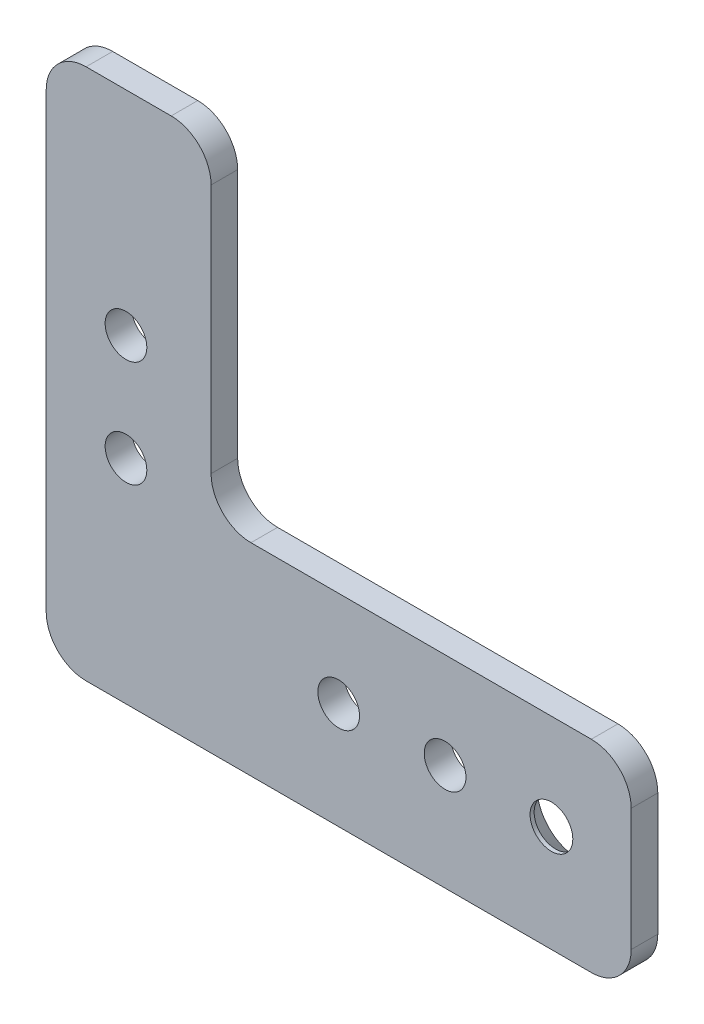
ISO-10303-21;
HEADER;
FILE_DESCRIPTION(('STEP AP214'),'2;1');
FILE_NAME('part.step','',(''),(''),'','','');
FILE_SCHEMA(('AUTOMOTIVE_DESIGN { 1 0 10303 214 1 1 1 1 }'));
ENDSEC;
DATA;
#1=APPLICATION_CONTEXT('core data for automotive mechanical design processes');
#2=APPLICATION_PROTOCOL_DEFINITION('international standard','automotive_design',2000,#1);
#3=PRODUCT_CONTEXT('',#1,'mechanical');
#4=PRODUCT('Part','Part','',(#3));
#5=PRODUCT_RELATED_PRODUCT_CATEGORY('part','',(#4));
#6=PRODUCT_DEFINITION_FORMATION('','',#4);
#7=PRODUCT_DEFINITION_CONTEXT('part definition',#1,'design');
#8=PRODUCT_DEFINITION('design','',#6,#7);
#9=PRODUCT_DEFINITION_SHAPE('','',#8);
#10=(LENGTH_UNIT() NAMED_UNIT(*) SI_UNIT(.MILLI.,.METRE.));
#11=(NAMED_UNIT(*) PLANE_ANGLE_UNIT() SI_UNIT($,.RADIAN.));
#12=(NAMED_UNIT(*) SI_UNIT($,.STERADIAN.) SOLID_ANGLE_UNIT());
#13=UNCERTAINTY_MEASURE_WITH_UNIT(LENGTH_MEASURE(1.E-05),#10,'distance_accuracy_value','');
#14=(GEOMETRIC_REPRESENTATION_CONTEXT(3) GLOBAL_UNCERTAINTY_ASSIGNED_CONTEXT((#13)) GLOBAL_UNIT_ASSIGNED_CONTEXT((#10,
#11,#12)) REPRESENTATION_CONTEXT('',''));
#15=CARTESIAN_POINT('',(0.,0.,0.));
#16=DIRECTION('',(0.,0.,1.));
#17=DIRECTION('',(1.,0.,0.));
#18=AXIS2_PLACEMENT_3D('',#15,#16,#17);
#19=CARTESIAN_POINT('',(-34.925,-31.75,-3.175));
#20=DIRECTION('',(1.,0.,0.));
#21=DIRECTION('',(0.,0.,-1.));
#22=AXIS2_PLACEMENT_3D('',#19,#20,#21);
#23=PLANE('',#22);
#24=DIRECTION('',(0.,1.,0.));
#25=VECTOR('',#24,1.);
#26=CARTESIAN_POINT('',(-34.925,-31.75,0.));
#27=LINE('',#26,#25);
#28=CARTESIAN_POINT('',(-34.925,-26.9875,0.));
#29=VERTEX_POINT('',#28);
#30=CARTESIAN_POINT('',(-34.925,26.9875,0.));
#31=VERTEX_POINT('',#30);
#32=EDGE_CURVE('E133',#29,#31,#27,.T.);
#33=ORIENTED_EDGE('',*,*,#32,.T.);
#34=DIRECTION('',(0.,0.,1.));
#35=VECTOR('',#34,1.);
#36=CARTESIAN_POINT('',(-34.925,26.9875,-3.175));
#37=LINE('',#36,#35);
#38=CARTESIAN_POINT('',(-34.925,26.9875,-3.175));
#39=VERTEX_POINT('',#38);
#40=EDGE_CURVE('E198',#31,#39,#37,.F.);
#41=ORIENTED_EDGE('',*,*,#40,.T.);
#42=DIRECTION('',(0.,1.,0.));
#43=VECTOR('',#42,1.);
#44=CARTESIAN_POINT('',(-34.925,-31.75,-3.175));
#45=LINE('',#44,#43);
#46=CARTESIAN_POINT('',(-34.925,-26.9875,-3.175));
#47=VERTEX_POINT('',#46);
#48=EDGE_CURVE('E149',#47,#39,#45,.T.);
#49=ORIENTED_EDGE('',*,*,#48,.F.);
#50=DIRECTION('',(0.,0.,1.));
#51=VECTOR('',#50,1.);
#52=CARTESIAN_POINT('',(-34.925,-26.9875,0.));
#53=LINE('',#52,#51);
#54=EDGE_CURVE('E196',#47,#29,#53,.T.);
#55=ORIENTED_EDGE('',*,*,#54,.T.);
#56=EDGE_LOOP('',(#33,#41,#49,#55));
#57=FACE_BOUND('',#56,.T.);
#58=ADVANCED_FACE('F38',(#57),#23,.F.);
#59=CARTESIAN_POINT('',(-15.24,31.75,-3.175));
#60=DIRECTION('',(0.,1.,0.));
#61=DIRECTION('',(0.,0.,1.));
#62=AXIS2_PLACEMENT_3D('',#59,#60,#61);
#63=PLANE('',#62);
#64=DIRECTION('',(-1.,0.,0.));
#65=VECTOR('',#64,1.);
#66=CARTESIAN_POINT('',(-15.24,31.75,-3.175));
#67=LINE('',#66,#65);
#68=CARTESIAN_POINT('',(-20.0025,31.75,-3.175));
#69=VERTEX_POINT('',#68);
#70=CARTESIAN_POINT('',(-30.1625,31.75,-3.175));
#71=VERTEX_POINT('',#70);
#72=EDGE_CURVE('E222',#69,#71,#67,.T.);
#73=ORIENTED_EDGE('',*,*,#72,.T.);
#74=DIRECTION('',(0.,0.,1.));
#75=VECTOR('',#74,1.);
#76=CARTESIAN_POINT('',(-30.1625,31.75,0.));
#77=LINE('',#76,#75);
#78=CARTESIAN_POINT('',(-30.1625,31.75,0.));
#79=VERTEX_POINT('',#78);
#80=EDGE_CURVE('E193',#71,#79,#77,.T.);
#81=ORIENTED_EDGE('',*,*,#80,.T.);
#82=DIRECTION('',(-1.,0.,0.));
#83=VECTOR('',#82,1.);
#84=CARTESIAN_POINT('',(-15.24,31.75,0.));
#85=LINE('',#84,#83);
#86=CARTESIAN_POINT('',(-20.0025,31.75,0.));
#87=VERTEX_POINT('',#86);
#88=EDGE_CURVE('E212',#87,#79,#85,.T.);
#89=ORIENTED_EDGE('',*,*,#88,.F.);
#90=DIRECTION('',(0.,0.,1.));
#91=VECTOR('',#90,1.);
#92=CARTESIAN_POINT('',(-20.0025,31.75,-3.175));
#93=LINE('',#92,#91);
#94=EDGE_CURVE('E191',#87,#69,#93,.F.);
#95=ORIENTED_EDGE('',*,*,#94,.T.);
#96=EDGE_LOOP('',(#73,#81,#89,#95));
#97=FACE_BOUND('',#96,.T.);
#98=ADVANCED_FACE('F254',(#97),#63,.T.);
#99=CARTESIAN_POINT('',(-15.24,31.75,-3.175));
#100=DIRECTION('',(-1.,0.,0.));
#101=DIRECTION('',(0.,-1.,0.));
#102=AXIS2_PLACEMENT_3D('',#99,#100,#101);
#103=PLANE('',#102);
#104=DIRECTION('',(0.,-1.,0.));
#105=VECTOR('',#104,1.);
#106=CARTESIAN_POINT('',(-15.24,31.75,0.));
#107=LINE('',#106,#105);
#108=CARTESIAN_POINT('',(-15.24,26.9875,0.));
#109=VERTEX_POINT('',#108);
#110=CARTESIAN_POINT('',(-15.24,-2.85750000000001,0.));
#111=VERTEX_POINT('',#110);
#112=EDGE_CURVE('E203',#109,#111,#107,.T.);
#113=ORIENTED_EDGE('',*,*,#112,.T.);
#114=DIRECTION('',(0.,0.,1.));
#115=VECTOR('',#114,1.);
#116=CARTESIAN_POINT('',(-15.24,-2.85750000000001,-3.175));
#117=LINE('',#116,#115);
#118=CARTESIAN_POINT('',(-15.24,-2.85750000000001,-3.175));
#119=VERTEX_POINT('',#118);
#120=EDGE_CURVE('E189',#111,#119,#117,.F.);
#121=ORIENTED_EDGE('',*,*,#120,.T.);
#122=DIRECTION('',(0.,-1.,0.));
#123=VECTOR('',#122,1.);
#124=CARTESIAN_POINT('',(-15.24,31.75,-3.175));
#125=LINE('',#124,#123);
#126=CARTESIAN_POINT('',(-15.24,26.9875,-3.175));
#127=VERTEX_POINT('',#126);
#128=EDGE_CURVE('E218',#127,#119,#125,.T.);
#129=ORIENTED_EDGE('',*,*,#128,.F.);
#130=DIRECTION('',(0.,0.,1.));
#131=VECTOR('',#130,1.);
#132=CARTESIAN_POINT('',(-15.24,26.9875,0.));
#133=LINE('',#132,#131);
#134=EDGE_CURVE('E186',#127,#109,#133,.T.);
#135=ORIENTED_EDGE('',*,*,#134,.T.);
#136=EDGE_LOOP('',(#113,#121,#129,#135));
#137=FACE_BOUND('',#136,.T.);
#138=ADVANCED_FACE('F209',(#137),#103,.F.);
#139=CARTESIAN_POINT('',(34.925,-7.62000000000001,-3.175));
#140=DIRECTION('',(0.,1.,0.));
#141=DIRECTION('',(-1.,0.,0.));
#142=AXIS2_PLACEMENT_3D('',#139,#140,#141);
#143=PLANE('',#142);
#144=DIRECTION('',(-1.,0.,0.));
#145=VECTOR('',#144,1.);
#146=CARTESIAN_POINT('',(34.925,-7.62000000000001,0.));
#147=LINE('',#146,#145);
#148=CARTESIAN_POINT('',(30.1625,-7.62000000000001,0.));
#149=VERTEX_POINT('',#148);
#150=CARTESIAN_POINT('',(-10.4775,-7.62000000000001,0.));
#151=VERTEX_POINT('',#150);
#152=EDGE_CURVE('E204',#149,#151,#147,.T.);
#153=ORIENTED_EDGE('',*,*,#152,.F.);
#154=DIRECTION('',(0.,0.,1.));
#155=VECTOR('',#154,1.);
#156=CARTESIAN_POINT('',(30.1625,-7.62000000000001,-3.175));
#157=LINE('',#156,#155);
#158=CARTESIAN_POINT('',(30.1625,-7.62000000000001,-3.175));
#159=VERTEX_POINT('',#158);
#160=EDGE_CURVE('E59',#149,#159,#157,.F.);
#161=ORIENTED_EDGE('',*,*,#160,.T.);
#162=DIRECTION('',(-1.,0.,0.));
#163=VECTOR('',#162,1.);
#164=CARTESIAN_POINT('',(34.925,-7.62000000000001,-3.175));
#165=LINE('',#164,#163);
#166=CARTESIAN_POINT('',(-10.4775,-7.62000000000001,-3.175));
#167=VERTEX_POINT('',#166);
#168=EDGE_CURVE('E216',#159,#167,#165,.T.);
#169=ORIENTED_EDGE('',*,*,#168,.T.);
#170=DIRECTION('',(0.,0.,1.));
#171=VECTOR('',#170,1.);
#172=CARTESIAN_POINT('',(-10.4775,-7.62000000000001,-3.175));
#173=LINE('',#172,#171);
#174=EDGE_CURVE('E182',#167,#151,#173,.T.);
#175=ORIENTED_EDGE('',*,*,#174,.T.);
#176=EDGE_LOOP('',(#153,#161,#169,#175));
#177=FACE_BOUND('',#176,.T.);
#178=ADVANCED_FACE('F215',(#177),#143,.T.);
#179=CARTESIAN_POINT('',(34.925,-7.62000000000001,-3.175));
#180=DIRECTION('',(-1.,0.,0.));
#181=DIRECTION('',(0.,-1.,0.));
#182=AXIS2_PLACEMENT_3D('',#179,#180,#181);
#183=PLANE('',#182);
#184=DIRECTION('',(0.,-1.,0.));
#185=VECTOR('',#184,1.);
#186=CARTESIAN_POINT('',(34.925,-7.62000000000001,0.));
#187=LINE('',#186,#185);
#188=CARTESIAN_POINT('',(34.925,-12.3825,0.));
#189=VERTEX_POINT('',#188);
#190=CARTESIAN_POINT('',(34.925,-26.9875,0.));
#191=VERTEX_POINT('',#190);
#192=EDGE_CURVE('E150',#189,#191,#187,.T.);
#193=ORIENTED_EDGE('',*,*,#192,.T.);
#194=DIRECTION('',(0.,0.,1.));
#195=VECTOR('',#194,1.);
#196=CARTESIAN_POINT('',(34.925,-26.9875,-3.175));
#197=LINE('',#196,#195);
#198=CARTESIAN_POINT('',(34.925,-26.9875,-3.175));
#199=VERTEX_POINT('',#198);
#200=EDGE_CURVE('E171',#191,#199,#197,.F.);
#201=ORIENTED_EDGE('',*,*,#200,.T.);
#202=DIRECTION('',(0.,-1.,0.));
#203=VECTOR('',#202,1.);
#204=CARTESIAN_POINT('',(34.925,-7.62000000000001,-3.175));
#205=LINE('',#204,#203);
#206=CARTESIAN_POINT('',(34.925,-12.3825,-3.175));
#207=VERTEX_POINT('',#206);
#208=EDGE_CURVE('E158',#207,#199,#205,.T.);
#209=ORIENTED_EDGE('',*,*,#208,.F.);
#210=DIRECTION('',(0.,0.,1.));
#211=VECTOR('',#210,1.);
#212=CARTESIAN_POINT('',(34.925,-12.3825,0.));
#213=LINE('',#212,#211);
#214=EDGE_CURVE('E168',#207,#189,#213,.T.);
#215=ORIENTED_EDGE('',*,*,#214,.T.);
#216=EDGE_LOOP('',(#193,#201,#209,#215));
#217=FACE_BOUND('',#216,.T.);
#218=ADVANCED_FACE('F234',(#217),#183,.F.);
#219=CARTESIAN_POINT('',(-34.925,-31.75,-3.175));
#220=DIRECTION('',(0.,-1.,0.));
#221=DIRECTION('',(0.,0.,-1.));
#222=AXIS2_PLACEMENT_3D('',#219,#220,#221);
#223=PLANE('',#222);
#224=DIRECTION('',(1.,0.,0.));
#225=VECTOR('',#224,1.);
#226=CARTESIAN_POINT('',(-34.925,-31.75,-3.175));
#227=LINE('',#226,#225);
#228=CARTESIAN_POINT('',(-30.1625,-31.75,-3.175));
#229=VERTEX_POINT('',#228);
#230=CARTESIAN_POINT('',(30.1625,-31.75,-3.175));
#231=VERTEX_POINT('',#230);
#232=EDGE_CURVE('E155',#229,#231,#227,.T.);
#233=ORIENTED_EDGE('',*,*,#232,.T.);
#234=DIRECTION('',(0.,0.,1.));
#235=VECTOR('',#234,1.);
#236=CARTESIAN_POINT('',(30.1625,-31.75,0.));
#237=LINE('',#236,#235);
#238=CARTESIAN_POINT('',(30.1625,-31.75,0.));
#239=VERTEX_POINT('',#238);
#240=EDGE_CURVE('E148',#231,#239,#237,.T.);
#241=ORIENTED_EDGE('',*,*,#240,.T.);
#242=DIRECTION('',(1.,0.,0.));
#243=VECTOR('',#242,1.);
#244=CARTESIAN_POINT('',(-34.925,-31.75,0.));
#245=LINE('',#244,#243);
#246=CARTESIAN_POINT('',(-30.1625,-31.75,0.));
#247=VERTEX_POINT('',#246);
#248=EDGE_CURVE('E131',#247,#239,#245,.T.);
#249=ORIENTED_EDGE('',*,*,#248,.F.);
#250=DIRECTION('',(0.,0.,1.));
#251=VECTOR('',#250,1.);
#252=CARTESIAN_POINT('',(-30.1625,-31.75,-3.175));
#253=LINE('',#252,#251);
#254=EDGE_CURVE('E145',#247,#229,#253,.F.);
#255=ORIENTED_EDGE('',*,*,#254,.T.);
#256=EDGE_LOOP('',(#233,#241,#249,#255));
#257=FACE_BOUND('',#256,.T.);
#258=ADVANCED_FACE('F144',(#257),#223,.T.);
#259=CARTESIAN_POINT('',(0.,0.,-3.175));
#260=DIRECTION('',(0.,0.,1.));
#261=DIRECTION('',(1.,0.,0.));
#262=AXIS2_PLACEMENT_3D('',#259,#260,#261);
#263=PLANE('',#262);
#264=CARTESIAN_POINT('',(25.4,-19.05,-3.175));
#265=DIRECTION('',(0.,0.,-1.));
#266=DIRECTION('',(-1.,0.,0.));
#267=AXIS2_PLACEMENT_3D('',#264,#265,#266);
#268=CIRCLE('',#267,4.8895);
#269=CARTESIAN_POINT('',(20.5105,-19.05,-3.175));
#270=VERTEX_POINT('',#269);
#271=EDGE_CURVE('E307',#270,#270,#268,.T.);
#272=ORIENTED_EDGE('',*,*,#271,.F.);
#273=EDGE_LOOP('',(#272));
#274=FACE_BOUND('',#273,.T.);
#275=CARTESIAN_POINT('',(0.,-19.05,-3.175));
#276=DIRECTION('',(0.,0.,1.));
#277=DIRECTION('',(1.,0.,0.));
#278=AXIS2_PLACEMENT_3D('',#275,#276,#277);
#279=CIRCLE('',#278,2.4892);
#280=CARTESIAN_POINT('',(2.48919999999999,-19.05,-3.175));
#281=VERTEX_POINT('',#280);
#282=EDGE_CURVE('E311',#281,#281,#279,.T.);
#283=ORIENTED_EDGE('',*,*,#282,.T.);
#284=EDGE_LOOP('',(#283));
#285=FACE_BOUND('',#284,.T.);
#286=CARTESIAN_POINT('',(12.7,-19.05,-3.175));
#287=DIRECTION('',(0.,0.,1.));
#288=DIRECTION('',(1.,0.,0.));
#289=AXIS2_PLACEMENT_3D('',#286,#287,#288);
#290=CIRCLE('',#289,2.4892);
#291=CARTESIAN_POINT('',(15.1892,-19.05,-3.175));
#292=VERTEX_POINT('',#291);
#293=EDGE_CURVE('E318',#292,#292,#290,.T.);
#294=ORIENTED_EDGE('',*,*,#293,.T.);
#295=EDGE_LOOP('',(#294));
#296=FACE_BOUND('',#295,.T.);
#297=CARTESIAN_POINT('',(-25.4,-6.35,-3.175));
#298=DIRECTION('',(0.,0.,1.));
#299=DIRECTION('',(1.,0.,0.));
#300=AXIS2_PLACEMENT_3D('',#297,#298,#299);
#301=CIRCLE('',#300,2.4892);
#302=CARTESIAN_POINT('',(-22.9108,-6.35,-3.175));
#303=VERTEX_POINT('',#302);
#304=EDGE_CURVE('E324',#303,#303,#301,.T.);
#305=ORIENTED_EDGE('',*,*,#304,.T.);
#306=EDGE_LOOP('',(#305));
#307=FACE_BOUND('',#306,.T.);
#308=CARTESIAN_POINT('',(-25.4,6.35,-3.175));
#309=DIRECTION('',(0.,0.,1.));
#310=DIRECTION('',(1.,0.,0.));
#311=AXIS2_PLACEMENT_3D('',#308,#309,#310);
#312=CIRCLE('',#311,2.4892);
#313=CARTESIAN_POINT('',(-22.9108,6.35,-3.175));
#314=VERTEX_POINT('',#313);
#315=EDGE_CURVE('E227',#314,#314,#312,.T.);
#316=ORIENTED_EDGE('',*,*,#315,.T.);
#317=EDGE_LOOP('',(#316));
#318=FACE_BOUND('',#317,.T.);
#319=ORIENTED_EDGE('',*,*,#208,.T.);
#320=CARTESIAN_POINT('',(30.1625,-26.9875,-3.175));
#321=DIRECTION('',(0.,0.,1.));
#322=DIRECTION('',(1.,0.,0.));
#323=AXIS2_PLACEMENT_3D('',#320,#321,#322);
#324=CIRCLE('',#323,4.7625);
#325=EDGE_CURVE('E180',#199,#231,#324,.F.);
#326=ORIENTED_EDGE('',*,*,#325,.T.);
#327=ORIENTED_EDGE('',*,*,#232,.F.);
#328=CARTESIAN_POINT('',(-30.1625,-26.9875,-3.175));
#329=DIRECTION('',(0.,0.,1.));
#330=DIRECTION('',(1.,0.,0.));
#331=AXIS2_PLACEMENT_3D('',#328,#329,#330);
#332=CIRCLE('',#331,4.7625);
#333=EDGE_CURVE('E154',#229,#47,#332,.F.);
#334=ORIENTED_EDGE('',*,*,#333,.T.);
#335=ORIENTED_EDGE('',*,*,#48,.T.);
#336=CARTESIAN_POINT('',(-30.1625,26.9875,-3.175));
#337=DIRECTION('',(0.,0.,1.));
#338=DIRECTION('',(1.,0.,0.));
#339=AXIS2_PLACEMENT_3D('',#336,#337,#338);
#340=CIRCLE('',#339,4.7625);
#341=EDGE_CURVE('E176',#39,#71,#340,.F.);
#342=ORIENTED_EDGE('',*,*,#341,.T.);
#343=ORIENTED_EDGE('',*,*,#72,.F.);
#344=CARTESIAN_POINT('',(-20.0025,26.9875,-3.175));
#345=DIRECTION('',(0.,0.,1.));
#346=DIRECTION('',(1.,0.,0.));
#347=AXIS2_PLACEMENT_3D('',#344,#345,#346);
#348=CIRCLE('',#347,4.7625);
#349=EDGE_CURVE('E173',#69,#127,#348,.F.);
#350=ORIENTED_EDGE('',*,*,#349,.T.);
#351=ORIENTED_EDGE('',*,*,#128,.T.);
#352=CARTESIAN_POINT('',(-10.4775,-2.85750000000001,-3.175));
#353=DIRECTION('',(0.,0.,1.));
#354=DIRECTION('',(1.,0.,0.));
#355=AXIS2_PLACEMENT_3D('',#352,#353,#354);
#356=CIRCLE('',#355,4.7625);
#357=EDGE_CURVE('E11',#119,#167,#356,.T.);
#358=ORIENTED_EDGE('',*,*,#357,.T.);
#359=ORIENTED_EDGE('',*,*,#168,.F.);
#360=CARTESIAN_POINT('',(30.1625,-12.3825,-3.175));
#361=DIRECTION('',(0.,0.,1.));
#362=DIRECTION('',(1.,0.,0.));
#363=AXIS2_PLACEMENT_3D('',#360,#361,#362);
#364=CIRCLE('',#363,4.7625);
#365=EDGE_CURVE('E178',#159,#207,#364,.F.);
#366=ORIENTED_EDGE('',*,*,#365,.T.);
#367=EDGE_LOOP('',(#319,#326,#327,#334,#335,#342,#343,#350,#351,#358,#359,#366));
#368=FACE_BOUND('',#367,.T.);
#369=ADVANCED_FACE('F240',(#274,#285,#296,#307,#318,#368),#263,.F.);
#370=CARTESIAN_POINT('',(0.,0.,0.));
#371=DIRECTION('',(0.,0.,1.));
#372=DIRECTION('',(1.,0.,0.));
#373=AXIS2_PLACEMENT_3D('',#370,#371,#372);
#374=PLANE('',#373);
#375=CARTESIAN_POINT('',(25.4,-19.05,0.));
#376=DIRECTION('',(0.,0.,1.));
#377=DIRECTION('',(1.,0.,0.));
#378=AXIS2_PLACEMENT_3D('',#375,#376,#377);
#379=CIRCLE('',#378,2.55269999999999);
#380=CARTESIAN_POINT('',(27.9527,-19.05,0.));
#381=VERTEX_POINT('',#380);
#382=EDGE_CURVE('E42',#381,#381,#379,.T.);
#383=ORIENTED_EDGE('',*,*,#382,.F.);
#384=EDGE_LOOP('',(#383));
#385=FACE_BOUND('',#384,.T.);
#386=CARTESIAN_POINT('',(0.,-19.05,0.));
#387=DIRECTION('',(0.,0.,1.));
#388=DIRECTION('',(1.,0.,0.));
#389=AXIS2_PLACEMENT_3D('',#386,#387,#388);
#390=CIRCLE('',#389,2.4892);
#391=CARTESIAN_POINT('',(2.48919999999999,-19.05,0.));
#392=VERTEX_POINT('',#391);
#393=EDGE_CURVE('E315',#392,#392,#390,.T.);
#394=ORIENTED_EDGE('',*,*,#393,.F.);
#395=EDGE_LOOP('',(#394));
#396=FACE_BOUND('',#395,.T.);
#397=CARTESIAN_POINT('',(12.7,-19.05,0.));
#398=DIRECTION('',(0.,0.,1.));
#399=DIRECTION('',(1.,0.,0.));
#400=AXIS2_PLACEMENT_3D('',#397,#398,#399);
#401=CIRCLE('',#400,2.4892);
#402=CARTESIAN_POINT('',(15.1892,-19.05,0.));
#403=VERTEX_POINT('',#402);
#404=EDGE_CURVE('E314',#403,#403,#401,.T.);
#405=ORIENTED_EDGE('',*,*,#404,.F.);
#406=EDGE_LOOP('',(#405));
#407=FACE_BOUND('',#406,.T.);
#408=CARTESIAN_POINT('',(-25.4,-6.35,0.));
#409=DIRECTION('',(0.,0.,1.));
#410=DIRECTION('',(1.,0.,0.));
#411=AXIS2_PLACEMENT_3D('',#408,#409,#410);
#412=CIRCLE('',#411,2.4892);
#413=CARTESIAN_POINT('',(-22.9108,-6.35,0.));
#414=VERTEX_POINT('',#413);
#415=EDGE_CURVE('E321',#414,#414,#412,.T.);
#416=ORIENTED_EDGE('',*,*,#415,.F.);
#417=EDGE_LOOP('',(#416));
#418=FACE_BOUND('',#417,.T.);
#419=CARTESIAN_POINT('',(-25.4,6.35,0.));
#420=DIRECTION('',(0.,0.,1.));
#421=DIRECTION('',(1.,0.,0.));
#422=AXIS2_PLACEMENT_3D('',#419,#420,#421);
#423=CIRCLE('',#422,2.4892);
#424=CARTESIAN_POINT('',(-22.9108,6.35,0.));
#425=VERTEX_POINT('',#424);
#426=EDGE_CURVE('E327',#425,#425,#423,.T.);
#427=ORIENTED_EDGE('',*,*,#426,.F.);
#428=EDGE_LOOP('',(#427));
#429=FACE_BOUND('',#428,.T.);
#430=ORIENTED_EDGE('',*,*,#248,.T.);
#431=CARTESIAN_POINT('',(30.1625,-26.9875,0.));
#432=DIRECTION('',(0.,0.,1.));
#433=DIRECTION('',(1.,0.,0.));
#434=AXIS2_PLACEMENT_3D('',#431,#432,#433);
#435=CIRCLE('',#434,4.7625);
#436=EDGE_CURVE('E166',#239,#191,#435,.T.);
#437=ORIENTED_EDGE('',*,*,#436,.T.);
#438=ORIENTED_EDGE('',*,*,#192,.F.);
#439=CARTESIAN_POINT('',(30.1625,-12.3825,0.));
#440=DIRECTION('',(0.,0.,1.));
#441=DIRECTION('',(1.,0.,0.));
#442=AXIS2_PLACEMENT_3D('',#439,#440,#441);
#443=CIRCLE('',#442,4.7625);
#444=EDGE_CURVE('E164',#189,#149,#443,.T.);
#445=ORIENTED_EDGE('',*,*,#444,.T.);
#446=ORIENTED_EDGE('',*,*,#152,.T.);
#447=CARTESIAN_POINT('',(-10.4775,-2.85750000000001,0.));
#448=DIRECTION('',(0.,0.,1.));
#449=DIRECTION('',(1.,0.,0.));
#450=AXIS2_PLACEMENT_3D('',#447,#448,#449);
#451=CIRCLE('',#450,4.7625);
#452=EDGE_CURVE('E47',#151,#111,#451,.F.);
#453=ORIENTED_EDGE('',*,*,#452,.T.);
#454=ORIENTED_EDGE('',*,*,#112,.F.);
#455=CARTESIAN_POINT('',(-20.0025,26.9875,0.));
#456=DIRECTION('',(0.,0.,1.));
#457=DIRECTION('',(1.,0.,0.));
#458=AXIS2_PLACEMENT_3D('',#455,#456,#457);
#459=CIRCLE('',#458,4.7625);
#460=EDGE_CURVE('E139',#109,#87,#459,.T.);
#461=ORIENTED_EDGE('',*,*,#460,.T.);
#462=ORIENTED_EDGE('',*,*,#88,.T.);
#463=CARTESIAN_POINT('',(-30.1625,26.9875,0.));
#464=DIRECTION('',(0.,0.,1.));
#465=DIRECTION('',(1.,0.,0.));
#466=AXIS2_PLACEMENT_3D('',#463,#464,#465);
#467=CIRCLE('',#466,4.7625);
#468=EDGE_CURVE('E138',#79,#31,#467,.T.);
#469=ORIENTED_EDGE('',*,*,#468,.T.);
#470=ORIENTED_EDGE('',*,*,#32,.F.);
#471=CARTESIAN_POINT('',(-30.1625,-26.9875,0.));
#472=DIRECTION('',(0.,0.,1.));
#473=DIRECTION('',(1.,0.,0.));
#474=AXIS2_PLACEMENT_3D('',#471,#472,#473);
#475=CIRCLE('',#474,4.7625);
#476=EDGE_CURVE('E128',#29,#247,#475,.T.);
#477=ORIENTED_EDGE('',*,*,#476,.T.);
#478=EDGE_LOOP('',(#430,#437,#438,#445,#446,#453,#454,#461,#462,#469,#470,#477));
#479=FACE_BOUND('',#478,.T.);
#480=ADVANCED_FACE('F130',(#385,#396,#407,#418,#429,#479),#374,.T.);
#481=CARTESIAN_POINT('',(-25.4,6.35,-3.175));
#482=DIRECTION('',(0.,0.,1.));
#483=DIRECTION('',(1.,0.,0.));
#484=AXIS2_PLACEMENT_3D('',#481,#482,#483);
#485=CYLINDRICAL_SURFACE('',#484,2.4892);
#486=ORIENTED_EDGE('',*,*,#315,.F.);
#487=EDGE_LOOP('',(#486));
#488=FACE_BOUND('',#487,.T.);
#489=ORIENTED_EDGE('',*,*,#426,.T.);
#490=EDGE_LOOP('',(#489));
#491=FACE_BOUND('',#490,.T.);
#492=ADVANCED_FACE('F273',(#488,#491),#485,.F.);
#493=CARTESIAN_POINT('',(-25.4,-6.35,-3.175));
#494=DIRECTION('',(0.,0.,1.));
#495=DIRECTION('',(1.,0.,0.));
#496=AXIS2_PLACEMENT_3D('',#493,#494,#495);
#497=CYLINDRICAL_SURFACE('',#496,2.4892);
#498=ORIENTED_EDGE('',*,*,#304,.F.);
#499=EDGE_LOOP('',(#498));
#500=FACE_BOUND('',#499,.T.);
#501=ORIENTED_EDGE('',*,*,#415,.T.);
#502=EDGE_LOOP('',(#501));
#503=FACE_BOUND('',#502,.T.);
#504=ADVANCED_FACE('F280',(#500,#503),#497,.F.);
#505=CARTESIAN_POINT('',(12.7,-19.05,-3.175));
#506=DIRECTION('',(0.,0.,1.));
#507=DIRECTION('',(1.,0.,0.));
#508=AXIS2_PLACEMENT_3D('',#505,#506,#507);
#509=CYLINDRICAL_SURFACE('',#508,2.4892);
#510=ORIENTED_EDGE('',*,*,#293,.F.);
#511=EDGE_LOOP('',(#510));
#512=FACE_BOUND('',#511,.T.);
#513=ORIENTED_EDGE('',*,*,#404,.T.);
#514=EDGE_LOOP('',(#513));
#515=FACE_BOUND('',#514,.T.);
#516=ADVANCED_FACE('F284',(#512,#515),#509,.F.);
#517=CARTESIAN_POINT('',(0.,-19.05,-3.175));
#518=DIRECTION('',(0.,0.,1.));
#519=DIRECTION('',(1.,0.,0.));
#520=AXIS2_PLACEMENT_3D('',#517,#518,#519);
#521=CYLINDRICAL_SURFACE('',#520,2.4892);
#522=ORIENTED_EDGE('',*,*,#282,.F.);
#523=EDGE_LOOP('',(#522));
#524=FACE_BOUND('',#523,.T.);
#525=ORIENTED_EDGE('',*,*,#393,.T.);
#526=EDGE_LOOP('',(#525));
#527=FACE_BOUND('',#526,.T.);
#528=ADVANCED_FACE('F251',(#524,#527),#521,.F.);
#529=CARTESIAN_POINT('',(30.1625,-26.9875,-3.175));
#530=DIRECTION('',(0.,0.,-1.));
#531=DIRECTION('',(-1.,0.,0.));
#532=AXIS2_PLACEMENT_3D('',#529,#530,#531);
#533=CYLINDRICAL_SURFACE('',#532,4.7625);
#534=ORIENTED_EDGE('',*,*,#325,.F.);
#535=ORIENTED_EDGE('',*,*,#200,.F.);
#536=ORIENTED_EDGE('',*,*,#436,.F.);
#537=ORIENTED_EDGE('',*,*,#240,.F.);
#538=EDGE_LOOP('',(#534,#535,#536,#537));
#539=FACE_BOUND('',#538,.T.);
#540=ADVANCED_FACE('F239',(#539),#533,.T.);
#541=CARTESIAN_POINT('',(30.1625,-12.3825,-3.175));
#542=DIRECTION('',(0.,0.,-1.));
#543=DIRECTION('',(-1.,0.,0.));
#544=AXIS2_PLACEMENT_3D('',#541,#542,#543);
#545=CYLINDRICAL_SURFACE('',#544,4.7625);
#546=ORIENTED_EDGE('',*,*,#365,.F.);
#547=ORIENTED_EDGE('',*,*,#160,.F.);
#548=ORIENTED_EDGE('',*,*,#444,.F.);
#549=ORIENTED_EDGE('',*,*,#214,.F.);
#550=EDGE_LOOP('',(#546,#547,#548,#549));
#551=FACE_BOUND('',#550,.T.);
#552=ADVANCED_FACE('F242',(#551),#545,.T.);
#553=CARTESIAN_POINT('',(-10.4775,-2.85750000000001,-3.175));
#554=DIRECTION('',(0.,0.,1.));
#555=DIRECTION('',(1.,0.,0.));
#556=AXIS2_PLACEMENT_3D('',#553,#554,#555);
#557=CYLINDRICAL_SURFACE('',#556,4.7625);
#558=ORIENTED_EDGE('',*,*,#357,.F.);
#559=ORIENTED_EDGE('',*,*,#120,.F.);
#560=ORIENTED_EDGE('',*,*,#452,.F.);
#561=ORIENTED_EDGE('',*,*,#174,.F.);
#562=EDGE_LOOP('',(#558,#559,#560,#561));
#563=FACE_BOUND('',#562,.T.);
#564=ADVANCED_FACE('F214',(#563),#557,.F.);
#565=CARTESIAN_POINT('',(-30.1625,26.9875,-3.175));
#566=DIRECTION('',(0.,0.,-1.));
#567=DIRECTION('',(-1.,0.,0.));
#568=AXIS2_PLACEMENT_3D('',#565,#566,#567);
#569=CYLINDRICAL_SURFACE('',#568,4.7625);
#570=ORIENTED_EDGE('',*,*,#341,.F.);
#571=ORIENTED_EDGE('',*,*,#40,.F.);
#572=ORIENTED_EDGE('',*,*,#468,.F.);
#573=ORIENTED_EDGE('',*,*,#80,.F.);
#574=EDGE_LOOP('',(#570,#571,#572,#573));
#575=FACE_BOUND('',#574,.T.);
#576=ADVANCED_FACE('F249',(#575),#569,.T.);
#577=CARTESIAN_POINT('',(-30.1625,-26.9875,-3.175));
#578=DIRECTION('',(0.,0.,-1.));
#579=DIRECTION('',(-1.,0.,0.));
#580=AXIS2_PLACEMENT_3D('',#577,#578,#579);
#581=CYLINDRICAL_SURFACE('',#580,4.7625);
#582=ORIENTED_EDGE('',*,*,#333,.F.);
#583=ORIENTED_EDGE('',*,*,#254,.F.);
#584=ORIENTED_EDGE('',*,*,#476,.F.);
#585=ORIENTED_EDGE('',*,*,#54,.F.);
#586=EDGE_LOOP('',(#582,#583,#584,#585));
#587=FACE_BOUND('',#586,.T.);
#588=ADVANCED_FACE('F153',(#587),#581,.T.);
#589=CARTESIAN_POINT('',(-20.0025,26.9875,-3.175));
#590=DIRECTION('',(0.,0.,-1.));
#591=DIRECTION('',(-1.,0.,0.));
#592=AXIS2_PLACEMENT_3D('',#589,#590,#591);
#593=CYLINDRICAL_SURFACE('',#592,4.7625);
#594=ORIENTED_EDGE('',*,*,#349,.F.);
#595=ORIENTED_EDGE('',*,*,#94,.F.);
#596=ORIENTED_EDGE('',*,*,#460,.F.);
#597=ORIENTED_EDGE('',*,*,#134,.F.);
#598=EDGE_LOOP('',(#594,#595,#596,#597));
#599=FACE_BOUND('',#598,.T.);
#600=ADVANCED_FACE('F40',(#599),#593,.T.);
#601=CARTESIAN_POINT('',(25.4,-19.05,-3.175));
#602=DIRECTION('',(0.,0.,-1.));
#603=DIRECTION('',(-1.,0.,0.));
#604=AXIS2_PLACEMENT_3D('',#601,#602,#603);
#605=CYLINDRICAL_SURFACE('',#604,2.55269999999999);
#606=ORIENTED_EDGE('',*,*,#382,.T.);
#607=EDGE_LOOP('',(#606));
#608=FACE_BOUND('',#607,.T.);
#609=CARTESIAN_POINT('',(25.4,-19.05,-0.486819106005928));
#610=DIRECTION('',(0.,0.,-1.));
#611=DIRECTION('',(-1.,0.,0.));
#612=AXIS2_PLACEMENT_3D('',#609,#610,#611);
#613=CIRCLE('',#612,2.55269999999999);
#614=CARTESIAN_POINT('',(22.8473,-19.05,-0.486819106005928));
#615=VERTEX_POINT('',#614);
#616=EDGE_CURVE('E304',#615,#615,#613,.T.);
#617=ORIENTED_EDGE('',*,*,#616,.T.);
#618=EDGE_LOOP('',(#617));
#619=FACE_BOUND('',#618,.T.);
#620=ADVANCED_FACE('F292',(#608,#619),#605,.F.);
#621=CARTESIAN_POINT('',(25.4,-19.05,-3.175));
#622=DIRECTION('',(0.,0.,-1.));
#623=DIRECTION('',(-1.,0.,0.));
#624=AXIS2_PLACEMENT_3D('',#621,#622,#623);
#625=CONICAL_SURFACE('',#624,4.8895,0.715584993317675);
#626=ORIENTED_EDGE('',*,*,#616,.F.);
#627=EDGE_LOOP('',(#626));
#628=FACE_BOUND('',#627,.T.);
#629=ORIENTED_EDGE('',*,*,#271,.T.);
#630=EDGE_LOOP('',(#629));
#631=FACE_BOUND('',#630,.T.);
#632=ADVANCED_FACE('F295',(#628,#631),#625,.F.);
#633=CLOSED_SHELL('',(#58,#98,#138,#178,#218,#258,#369,#480,#492,#504,#516,#528,#540,#552,#564,
#576,#588,#600,#620,#632));
#634=MANIFOLD_SOLID_BREP('B2',#633);
#635=ADVANCED_BREP_SHAPE_REPRESENTATION('',(#18,#634),#14);
#636=SHAPE_DEFINITION_REPRESENTATION(#9,#635);
ENDSEC;
END-ISO-10303-21;
